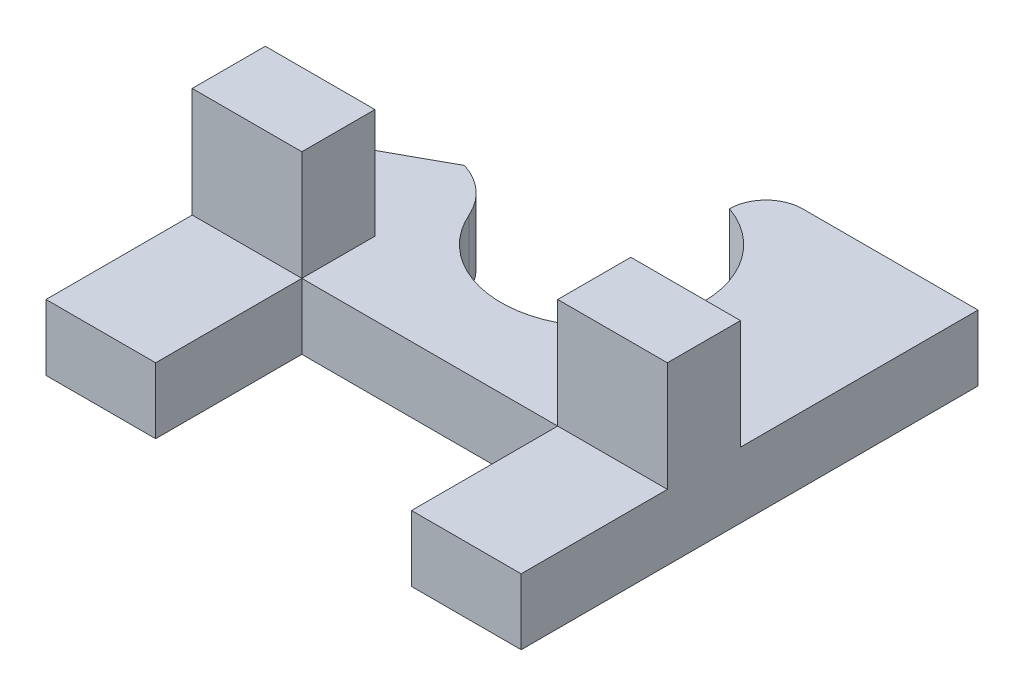
ISO-10303-21;
HEADER;
FILE_DESCRIPTION(('STEP AP214'),'2;1');
FILE_NAME('part.step','',(''),(''),'','','');
FILE_SCHEMA(('AUTOMOTIVE_DESIGN { 1 0 10303 214 1 1 1 1 }'));
ENDSEC;
DATA;
#1=APPLICATION_CONTEXT('core data for automotive mechanical design processes');
#2=APPLICATION_PROTOCOL_DEFINITION('international standard','automotive_design',2000,#1);
#3=PRODUCT_CONTEXT('',#1,'mechanical');
#4=PRODUCT('Part','Part','',(#3));
#5=PRODUCT_RELATED_PRODUCT_CATEGORY('part','',(#4));
#6=PRODUCT_DEFINITION_FORMATION('','',#4);
#7=PRODUCT_DEFINITION_CONTEXT('part definition',#1,'design');
#8=PRODUCT_DEFINITION('design','',#6,#7);
#9=PRODUCT_DEFINITION_SHAPE('','',#8);
#10=(LENGTH_UNIT() NAMED_UNIT(*) SI_UNIT(.MILLI.,.METRE.));
#11=(NAMED_UNIT(*) PLANE_ANGLE_UNIT() SI_UNIT($,.RADIAN.));
#12=(NAMED_UNIT(*) SI_UNIT($,.STERADIAN.) SOLID_ANGLE_UNIT());
#13=UNCERTAINTY_MEASURE_WITH_UNIT(LENGTH_MEASURE(1.E-05),#10,'distance_accuracy_value','');
#14=(GEOMETRIC_REPRESENTATION_CONTEXT(3) GLOBAL_UNCERTAINTY_ASSIGNED_CONTEXT((#13)) GLOBAL_UNIT_ASSIGNED_CONTEXT((#10,
#11,#12)) REPRESENTATION_CONTEXT('',''));
#15=CARTESIAN_POINT('',(0.,0.,0.));
#16=DIRECTION('',(0.,0.,1.));
#17=DIRECTION('',(1.,0.,0.));
#18=AXIS2_PLACEMENT_3D('',#15,#16,#17);
#19=CARTESIAN_POINT('',(-0.199999999999998,0.,-4.9));
#20=DIRECTION('',(0.,-1.,0.));
#21=DIRECTION('',(0.,0.,1.));
#22=AXIS2_PLACEMENT_3D('',#19,#20,#21);
#23=PLANE('',#22);
#24=DIRECTION('',(-1.,0.,0.));
#25=VECTOR('',#24,1.);
#26=CARTESIAN_POINT('',(-3.5,0.,0.));
#27=LINE('',#26,#25);
#28=CARTESIAN_POINT('',(-3.5,0.,0.));
#29=VERTEX_POINT('',#28);
#30=CARTESIAN_POINT('',(-6.5,0.,0.));
#31=VERTEX_POINT('',#30);
#32=EDGE_CURVE('E177',#29,#31,#27,.T.);
#33=ORIENTED_EDGE('',*,*,#32,.T.);
#34=DIRECTION('',(0.,0.,1.));
#35=VECTOR('',#34,1.);
#36=CARTESIAN_POINT('',(-6.5,0.,0.));
#37=LINE('',#36,#35);
#38=CARTESIAN_POINT('',(-6.5,0.,4.));
#39=VERTEX_POINT('',#38);
#40=EDGE_CURVE('E263',#31,#39,#37,.T.);
#41=ORIENTED_EDGE('',*,*,#40,.T.);
#42=DIRECTION('',(1.,0.,0.));
#43=VECTOR('',#42,1.);
#44=CARTESIAN_POINT('',(-6.5,0.,4.));
#45=LINE('',#44,#43);
#46=CARTESIAN_POINT('',(-3.5,0.,4.));
#47=VERTEX_POINT('',#46);
#48=EDGE_CURVE('E267',#39,#47,#45,.T.);
#49=ORIENTED_EDGE('',*,*,#48,.T.);
#50=DIRECTION('',(0.,0.,-1.));
#51=VECTOR('',#50,1.);
#52=CARTESIAN_POINT('',(-3.5,0.,0.));
#53=LINE('',#52,#51);
#54=EDGE_CURVE('E270',#47,#29,#53,.T.);
#55=ORIENTED_EDGE('',*,*,#54,.T.);
#56=EDGE_LOOP('',(#33,#41,#49,#55));
#57=FACE_BOUND('',#56,.T.);
#58=ADVANCED_FACE('F32',(#57),#23,.F.);
#59=DIRECTION('',(0.,0.,1.));
#60=VECTOR('',#59,1.);
#61=CARTESIAN_POINT('',(-3.5,0.,0.));
#62=LINE('',#61,#60);
#63=CARTESIAN_POINT('',(-3.5,0.,-2.));
#64=VERTEX_POINT('',#63);
#65=EDGE_CURVE('E193',#64,#29,#62,.T.);
#66=ORIENTED_EDGE('',*,*,#65,.T.);
#67=DIRECTION('',(1.,0.,0.));
#68=VECTOR('',#67,1.);
#69=CARTESIAN_POINT('',(3.5,0.,0.));
#70=LINE('',#69,#68);
#71=CARTESIAN_POINT('',(3.5,0.,0.));
#72=VERTEX_POINT('',#71);
#73=EDGE_CURVE('E273',#29,#72,#70,.T.);
#74=ORIENTED_EDGE('',*,*,#73,.T.);
#75=DIRECTION('',(0.,0.,-1.));
#76=VECTOR('',#75,1.);
#77=CARTESIAN_POINT('',(3.5,0.,0.));
#78=LINE('',#77,#76);
#79=CARTESIAN_POINT('',(3.5,0.,-2.));
#80=VERTEX_POINT('',#79);
#81=EDGE_CURVE('E181',#72,#80,#78,.T.);
#82=ORIENTED_EDGE('',*,*,#81,.T.);
#83=DIRECTION('',(1.,0.,0.));
#84=VECTOR('',#83,1.);
#85=CARTESIAN_POINT('',(3.5,0.,-2.));
#86=LINE('',#85,#84);
#87=CARTESIAN_POINT('',(6.5,0.,-2.));
#88=VERTEX_POINT('',#87);
#89=EDGE_CURVE('E214',#80,#88,#86,.T.);
#90=ORIENTED_EDGE('',*,*,#89,.T.);
#91=DIRECTION('',(0.,0.,-1.));
#92=VECTOR('',#91,1.);
#93=CARTESIAN_POINT('',(6.5,0.,-8.49855729203726));
#94=LINE('',#93,#92);
#95=CARTESIAN_POINT('',(6.5,0.,-8.49855729203726));
#96=VERTEX_POINT('',#95);
#97=EDGE_CURVE('E282',#88,#96,#94,.T.);
#98=ORIENTED_EDGE('',*,*,#97,.T.);
#99=DIRECTION('',(-1.,0.,0.));
#100=VECTOR('',#99,1.);
#101=CARTESIAN_POINT('',(0.699999999999999,0.,-8.49855729203726));
#102=LINE('',#101,#100);
#103=CARTESIAN_POINT('',(1.7,0.,-8.49855729203726));
#104=VERTEX_POINT('',#103);
#105=EDGE_CURVE('E230',#96,#104,#102,.T.);
#106=ORIENTED_EDGE('',*,*,#105,.T.);
#107=CARTESIAN_POINT('',(1.7,0.,-7.49855729203726));
#108=DIRECTION('',(0.,1.,0.));
#109=DIRECTION('',(0.,0.,1.));
#110=AXIS2_PLACEMENT_3D('',#107,#108,#109);
#111=CIRCLE('',#110,1.);
#112=CARTESIAN_POINT('',(0.699999999999999,0.,-7.49855729203726));
#113=VERTEX_POINT('',#112);
#114=EDGE_CURVE('E316',#113,#104,#111,.F.);
#115=ORIENTED_EDGE('',*,*,#114,.F.);
#116=CARTESIAN_POINT('',(-0.199999999999998,0.,-4.9));
#117=DIRECTION('',(0.,-1.,0.));
#118=DIRECTION('',(0.,0.,1.));
#119=AXIS2_PLACEMENT_3D('',#116,#117,#118);
#120=CIRCLE('',#119,2.75);
#121=CARTESIAN_POINT('',(-2.71842105263158,0.,-3.79543881941196));
#122=VERTEX_POINT('',#121);
#123=EDGE_CURVE('E225',#113,#122,#120,.T.);
#124=ORIENTED_EDGE('',*,*,#123,.T.);
#125=CARTESIAN_POINT('',(-4.55,0.,-2.99212159716611));
#126=DIRECTION('',(0.,1.,0.));
#127=DIRECTION('',(0.,0.,1.));
#128=AXIS2_PLACEMENT_3D('',#125,#126,#127);
#129=CIRCLE('',#128,2.);
#130=CARTESIAN_POINT('',(-3.95,0.,-4.9));
#131=VERTEX_POINT('',#130);
#132=EDGE_CURVE('E308',#131,#122,#129,.F.);
#133=ORIENTED_EDGE('',*,*,#132,.F.);
#134=DIRECTION('',(-0.876578550779595,0.,0.481258812192718));
#135=VECTOR('',#134,1.);
#136=CARTESIAN_POINT('',(-3.95,0.,-4.9));
#137=LINE('',#136,#135);
#138=CARTESIAN_POINT('',(-6.5,0.,-3.5));
#139=VERTEX_POINT('',#138);
#140=EDGE_CURVE('E260',#131,#139,#137,.T.);
#141=ORIENTED_EDGE('',*,*,#140,.T.);
#142=CARTESIAN_POINT('',(-6.5,0.,-2.));
#143=VERTEX_POINT('',#142);
#144=EDGE_CURVE('E264',#139,#143,#37,.T.);
#145=ORIENTED_EDGE('',*,*,#144,.T.);
#146=DIRECTION('',(1.,0.,0.));
#147=VECTOR('',#146,1.);
#148=CARTESIAN_POINT('',(-3.5,0.,-2.));
#149=LINE('',#148,#147);
#150=EDGE_CURVE('E185',#143,#64,#149,.T.);
#151=ORIENTED_EDGE('',*,*,#150,.T.);
#152=EDGE_LOOP('',(#66,#74,#82,#90,#98,#106,#115,#124,#133,#141,#145,#151));
#153=FACE_BOUND('',#152,.T.);
#154=ADVANCED_FACE('F336',(#153),#23,.F.);
#155=DIRECTION('',(-1.,0.,0.));
#156=VECTOR('',#155,1.);
#157=CARTESIAN_POINT('',(3.5,0.,0.));
#158=LINE('',#157,#156);
#159=CARTESIAN_POINT('',(6.5,0.,0.));
#160=VERTEX_POINT('',#159);
#161=EDGE_CURVE('E204',#160,#72,#158,.T.);
#162=ORIENTED_EDGE('',*,*,#161,.T.);
#163=DIRECTION('',(0.,0.,1.));
#164=VECTOR('',#163,1.);
#165=CARTESIAN_POINT('',(3.5,0.,0.));
#166=LINE('',#165,#164);
#167=CARTESIAN_POINT('',(3.5,0.,4.));
#168=VERTEX_POINT('',#167);
#169=EDGE_CURVE('E276',#72,#168,#166,.T.);
#170=ORIENTED_EDGE('',*,*,#169,.T.);
#171=DIRECTION('',(1.,0.,0.));
#172=VECTOR('',#171,1.);
#173=CARTESIAN_POINT('',(6.5,0.,4.));
#174=LINE('',#173,#172);
#175=CARTESIAN_POINT('',(6.5,0.,4.));
#176=VERTEX_POINT('',#175);
#177=EDGE_CURVE('E279',#168,#176,#174,.T.);
#178=ORIENTED_EDGE('',*,*,#177,.T.);
#179=EDGE_CURVE('E283',#176,#160,#94,.T.);
#180=ORIENTED_EDGE('',*,*,#179,.T.);
#181=EDGE_LOOP('',(#162,#170,#178,#180));
#182=FACE_BOUND('',#181,.T.);
#183=ADVANCED_FACE('F381',(#182),#23,.F.);
#184=CARTESIAN_POINT('',(-0.199999999999998,-1.8,-4.9));
#185=DIRECTION('',(0.,1.,0.));
#186=DIRECTION('',(0.,0.,-1.));
#187=AXIS2_PLACEMENT_3D('',#184,#185,#186);
#188=CYLINDRICAL_SURFACE('',#187,2.75);
#189=ORIENTED_EDGE('',*,*,#123,.F.);
#190=DIRECTION('',(0.,1.,0.));
#191=VECTOR('',#190,1.);
#192=CARTESIAN_POINT('',(0.699999999999999,-1.8,-7.49855729203726));
#193=LINE('',#192,#191);
#194=CARTESIAN_POINT('',(0.699999999999999,-1.8,-7.49855729203726));
#195=VERTEX_POINT('',#194);
#196=EDGE_CURVE('E257',#195,#113,#193,.T.);
#197=ORIENTED_EDGE('',*,*,#196,.F.);
#198=CARTESIAN_POINT('',(-0.199999999999998,-1.8,-4.9));
#199=DIRECTION('',(0.,-1.,0.));
#200=DIRECTION('',(0.,0.,1.));
#201=AXIS2_PLACEMENT_3D('',#198,#199,#200);
#202=CIRCLE('',#201,2.75);
#203=CARTESIAN_POINT('',(-2.71842105263158,-1.8,-3.79543881941196));
#204=VERTEX_POINT('',#203);
#205=EDGE_CURVE('E226',#195,#204,#202,.T.);
#206=ORIENTED_EDGE('',*,*,#205,.T.);
#207=DIRECTION('',(0.,1.,0.));
#208=VECTOR('',#207,1.);
#209=CARTESIAN_POINT('',(-2.71842105263158,-1.8,-3.79543881941196));
#210=LINE('',#209,#208);
#211=EDGE_CURVE('E311',#122,#204,#210,.F.);
#212=ORIENTED_EDGE('',*,*,#211,.F.);
#213=EDGE_LOOP('',(#189,#197,#206,#212));
#214=FACE_BOUND('',#213,.T.);
#215=ADVANCED_FACE('F333',(#214),#188,.F.);
#216=CARTESIAN_POINT('',(-3.95,-1.8,-4.9));
#217=DIRECTION('',(0.481258812192718,0.,0.876578550779595));
#218=DIRECTION('',(0.876578550779595,0.,-0.481258812192718));
#219=AXIS2_PLACEMENT_3D('',#216,#217,#218);
#220=PLANE('',#219);
#221=ORIENTED_EDGE('',*,*,#140,.F.);
#222=DIRECTION('',(0.,1.,0.));
#223=VECTOR('',#222,1.);
#224=CARTESIAN_POINT('',(-3.95,-1.8,-4.9));
#225=LINE('',#224,#223);
#226=CARTESIAN_POINT('',(-3.95,-1.8,-4.9));
#227=VERTEX_POINT('',#226);
#228=EDGE_CURVE('E306',#227,#131,#225,.T.);
#229=ORIENTED_EDGE('',*,*,#228,.F.);
#230=DIRECTION('',(-0.876578550779595,0.,0.481258812192718));
#231=VECTOR('',#230,1.);
#232=CARTESIAN_POINT('',(-3.95,-1.8,-4.9));
#233=LINE('',#232,#231);
#234=CARTESIAN_POINT('',(-6.5,-1.8,-3.5));
#235=VERTEX_POINT('',#234);
#236=EDGE_CURVE('E229',#227,#235,#233,.T.);
#237=ORIENTED_EDGE('',*,*,#236,.T.);
#238=DIRECTION('',(0.,1.,0.));
#239=VECTOR('',#238,1.);
#240=CARTESIAN_POINT('',(-6.5,-1.8,-3.5));
#241=LINE('',#240,#239);
#242=EDGE_CURVE('E304',#235,#139,#241,.T.);
#243=ORIENTED_EDGE('',*,*,#242,.T.);
#244=EDGE_LOOP('',(#221,#229,#237,#243));
#245=FACE_BOUND('',#244,.T.);
#246=ADVANCED_FACE('F371',(#245),#220,.F.);
#247=CARTESIAN_POINT('',(-6.5,-1.8,0.));
#248=DIRECTION('',(1.,0.,0.));
#249=DIRECTION('',(0.,0.,-1.));
#250=AXIS2_PLACEMENT_3D('',#247,#248,#249);
#251=PLANE('',#250);
#252=ORIENTED_EDGE('',*,*,#144,.F.);
#253=ORIENTED_EDGE('',*,*,#242,.F.);
#254=DIRECTION('',(0.,0.,1.));
#255=VECTOR('',#254,1.);
#256=CARTESIAN_POINT('',(-6.5,-1.8,-2.5));
#257=LINE('',#256,#255);
#258=CARTESIAN_POINT('',(-6.5,-1.8,4.));
#259=VERTEX_POINT('',#258);
#260=EDGE_CURVE('E233',#235,#259,#257,.T.);
#261=ORIENTED_EDGE('',*,*,#260,.T.);
#262=DIRECTION('',(0.,1.,0.));
#263=VECTOR('',#262,1.);
#264=CARTESIAN_POINT('',(-6.5,-1.8,4.));
#265=LINE('',#264,#263);
#266=EDGE_CURVE('E302',#259,#39,#265,.T.);
#267=ORIENTED_EDGE('',*,*,#266,.T.);
#268=ORIENTED_EDGE('',*,*,#40,.F.);
#269=DIRECTION('',(0.,-1.,0.));
#270=VECTOR('',#269,1.);
#271=CARTESIAN_POINT('',(-6.5,3.,0.));
#272=LINE('',#271,#270);
#273=CARTESIAN_POINT('',(-6.5,3.,0.));
#274=VERTEX_POINT('',#273);
#275=EDGE_CURVE('E47',#274,#31,#272,.T.);
#276=ORIENTED_EDGE('',*,*,#275,.F.);
#277=DIRECTION('',(0.,0.,-1.));
#278=VECTOR('',#277,1.);
#279=CARTESIAN_POINT('',(-6.5,3.,0.));
#280=LINE('',#279,#278);
#281=CARTESIAN_POINT('',(-6.5,3.,-2.));
#282=VERTEX_POINT('',#281);
#283=EDGE_CURVE('E172',#274,#282,#280,.T.);
#284=ORIENTED_EDGE('',*,*,#283,.T.);
#285=DIRECTION('',(0.,-1.,0.));
#286=VECTOR('',#285,1.);
#287=CARTESIAN_POINT('',(-6.5,3.,-2.));
#288=LINE('',#287,#286);
#289=EDGE_CURVE('E198',#282,#143,#288,.T.);
#290=ORIENTED_EDGE('',*,*,#289,.T.);
#291=EDGE_LOOP('',(#252,#253,#261,#267,#268,#276,#284,#290));
#292=FACE_BOUND('',#291,.T.);
#293=ADVANCED_FACE('F367',(#292),#251,.F.);
#294=CARTESIAN_POINT('',(-6.5,-1.8,4.));
#295=DIRECTION('',(0.,0.,-1.));
#296=DIRECTION('',(-1.,0.,0.));
#297=AXIS2_PLACEMENT_3D('',#294,#295,#296);
#298=PLANE('',#297);
#299=ORIENTED_EDGE('',*,*,#48,.F.);
#300=ORIENTED_EDGE('',*,*,#266,.F.);
#301=DIRECTION('',(1.,0.,0.));
#302=VECTOR('',#301,1.);
#303=CARTESIAN_POINT('',(-6.5,-1.8,4.));
#304=LINE('',#303,#302);
#305=CARTESIAN_POINT('',(-3.5,-1.8,4.));
#306=VERTEX_POINT('',#305);
#307=EDGE_CURVE('E236',#259,#306,#304,.T.);
#308=ORIENTED_EDGE('',*,*,#307,.T.);
#309=DIRECTION('',(0.,1.,0.));
#310=VECTOR('',#309,1.);
#311=CARTESIAN_POINT('',(-3.5,-1.8,4.));
#312=LINE('',#311,#310);
#313=EDGE_CURVE('E300',#306,#47,#312,.T.);
#314=ORIENTED_EDGE('',*,*,#313,.T.);
#315=EDGE_LOOP('',(#299,#300,#308,#314));
#316=FACE_BOUND('',#315,.T.);
#317=ADVANCED_FACE('F363',(#316),#298,.F.);
#318=CARTESIAN_POINT('',(-3.5,-1.8,0.));
#319=DIRECTION('',(-1.,0.,0.));
#320=DIRECTION('',(0.,0.,1.));
#321=AXIS2_PLACEMENT_3D('',#318,#319,#320);
#322=PLANE('',#321);
#323=ORIENTED_EDGE('',*,*,#54,.F.);
#324=ORIENTED_EDGE('',*,*,#313,.F.);
#325=DIRECTION('',(0.,0.,-1.));
#326=VECTOR('',#325,1.);
#327=CARTESIAN_POINT('',(-3.5,-1.8,0.));
#328=LINE('',#327,#326);
#329=CARTESIAN_POINT('',(-3.5,-1.8,0.));
#330=VERTEX_POINT('',#329);
#331=EDGE_CURVE('E239',#306,#330,#328,.T.);
#332=ORIENTED_EDGE('',*,*,#331,.T.);
#333=DIRECTION('',(0.,1.,0.));
#334=VECTOR('',#333,1.);
#335=CARTESIAN_POINT('',(-3.5,-1.8,0.));
#336=LINE('',#335,#334);
#337=EDGE_CURVE('E298',#330,#29,#336,.T.);
#338=ORIENTED_EDGE('',*,*,#337,.T.);
#339=EDGE_LOOP('',(#323,#324,#332,#338));
#340=FACE_BOUND('',#339,.T.);
#341=ADVANCED_FACE('F358',(#340),#322,.F.);
#342=CARTESIAN_POINT('',(3.5,-1.8,0.));
#343=DIRECTION('',(0.,0.,-1.));
#344=DIRECTION('',(-1.,0.,0.));
#345=AXIS2_PLACEMENT_3D('',#342,#343,#344);
#346=PLANE('',#345);
#347=ORIENTED_EDGE('',*,*,#73,.F.);
#348=ORIENTED_EDGE('',*,*,#337,.F.);
#349=DIRECTION('',(1.,0.,0.));
#350=VECTOR('',#349,1.);
#351=CARTESIAN_POINT('',(3.5,-1.8,0.));
#352=LINE('',#351,#350);
#353=CARTESIAN_POINT('',(3.5,-1.8,0.));
#354=VERTEX_POINT('',#353);
#355=EDGE_CURVE('E242',#330,#354,#352,.T.);
#356=ORIENTED_EDGE('',*,*,#355,.T.);
#357=DIRECTION('',(0.,1.,0.));
#358=VECTOR('',#357,1.);
#359=CARTESIAN_POINT('',(3.5,-1.8,0.));
#360=LINE('',#359,#358);
#361=EDGE_CURVE('E295',#354,#72,#360,.T.);
#362=ORIENTED_EDGE('',*,*,#361,.T.);
#363=EDGE_LOOP('',(#347,#348,#356,#362));
#364=FACE_BOUND('',#363,.T.);
#365=ADVANCED_FACE('F354',(#364),#346,.F.);
#366=CARTESIAN_POINT('',(3.5,-1.8,0.));
#367=DIRECTION('',(1.,0.,0.));
#368=DIRECTION('',(0.,0.,-1.));
#369=AXIS2_PLACEMENT_3D('',#366,#367,#368);
#370=PLANE('',#369);
#371=ORIENTED_EDGE('',*,*,#169,.F.);
#372=ORIENTED_EDGE('',*,*,#361,.F.);
#373=DIRECTION('',(0.,0.,1.));
#374=VECTOR('',#373,1.);
#375=CARTESIAN_POINT('',(3.5,-1.8,0.));
#376=LINE('',#375,#374);
#377=CARTESIAN_POINT('',(3.5,-1.8,4.));
#378=VERTEX_POINT('',#377);
#379=EDGE_CURVE('E245',#354,#378,#376,.T.);
#380=ORIENTED_EDGE('',*,*,#379,.T.);
#381=DIRECTION('',(0.,1.,0.));
#382=VECTOR('',#381,1.);
#383=CARTESIAN_POINT('',(3.5,-1.8,4.));
#384=LINE('',#383,#382);
#385=EDGE_CURVE('E293',#378,#168,#384,.T.);
#386=ORIENTED_EDGE('',*,*,#385,.T.);
#387=EDGE_LOOP('',(#371,#372,#380,#386));
#388=FACE_BOUND('',#387,.T.);
#389=ADVANCED_FACE('F351',(#388),#370,.F.);
#390=CARTESIAN_POINT('',(6.5,-1.8,4.));
#391=DIRECTION('',(0.,0.,-1.));
#392=DIRECTION('',(-1.,0.,0.));
#393=AXIS2_PLACEMENT_3D('',#390,#391,#392);
#394=PLANE('',#393);
#395=ORIENTED_EDGE('',*,*,#177,.F.);
#396=ORIENTED_EDGE('',*,*,#385,.F.);
#397=DIRECTION('',(1.,0.,0.));
#398=VECTOR('',#397,1.);
#399=CARTESIAN_POINT('',(6.5,-1.8,4.));
#400=LINE('',#399,#398);
#401=CARTESIAN_POINT('',(6.5,-1.8,4.));
#402=VERTEX_POINT('',#401);
#403=EDGE_CURVE('E248',#378,#402,#400,.T.);
#404=ORIENTED_EDGE('',*,*,#403,.T.);
#405=DIRECTION('',(0.,1.,0.));
#406=VECTOR('',#405,1.);
#407=CARTESIAN_POINT('',(6.5,-1.8,4.));
#408=LINE('',#407,#406);
#409=EDGE_CURVE('E291',#402,#176,#408,.T.);
#410=ORIENTED_EDGE('',*,*,#409,.T.);
#411=EDGE_LOOP('',(#395,#396,#404,#410));
#412=FACE_BOUND('',#411,.T.);
#413=ADVANCED_FACE('F346',(#412),#394,.F.);
#414=CARTESIAN_POINT('',(6.5,-1.8,-8.49855729203726));
#415=DIRECTION('',(-1.,0.,0.));
#416=DIRECTION('',(0.,0.,1.));
#417=AXIS2_PLACEMENT_3D('',#414,#415,#416);
#418=PLANE('',#417);
#419=ORIENTED_EDGE('',*,*,#179,.F.);
#420=ORIENTED_EDGE('',*,*,#409,.F.);
#421=DIRECTION('',(0.,0.,-1.));
#422=VECTOR('',#421,1.);
#423=CARTESIAN_POINT('',(6.5,-1.8,0.));
#424=LINE('',#423,#422);
#425=CARTESIAN_POINT('',(6.5,-1.8,-8.49855729203726));
#426=VERTEX_POINT('',#425);
#427=EDGE_CURVE('E251',#402,#426,#424,.T.);
#428=ORIENTED_EDGE('',*,*,#427,.T.);
#429=DIRECTION('',(0.,1.,0.));
#430=VECTOR('',#429,1.);
#431=CARTESIAN_POINT('',(6.5,-1.8,-8.49855729203726));
#432=LINE('',#431,#430);
#433=EDGE_CURVE('E289',#426,#96,#432,.T.);
#434=ORIENTED_EDGE('',*,*,#433,.T.);
#435=ORIENTED_EDGE('',*,*,#97,.F.);
#436=DIRECTION('',(0.,-1.,0.));
#437=VECTOR('',#436,1.);
#438=CARTESIAN_POINT('',(6.5,3.,-2.));
#439=LINE('',#438,#437);
#440=CARTESIAN_POINT('',(6.5,3.,-2.));
#441=VERTEX_POINT('',#440);
#442=EDGE_CURVE('E222',#441,#88,#439,.T.);
#443=ORIENTED_EDGE('',*,*,#442,.F.);
#444=DIRECTION('',(0.,0.,1.));
#445=VECTOR('',#444,1.);
#446=CARTESIAN_POINT('',(6.5,3.,0.));
#447=LINE('',#446,#445);
#448=CARTESIAN_POINT('',(6.5,3.,0.));
#449=VERTEX_POINT('',#448);
#450=EDGE_CURVE('E206',#441,#449,#447,.T.);
#451=ORIENTED_EDGE('',*,*,#450,.T.);
#452=DIRECTION('',(0.,-1.,0.));
#453=VECTOR('',#452,1.);
#454=CARTESIAN_POINT('',(6.5,3.,0.));
#455=LINE('',#454,#453);
#456=EDGE_CURVE('E220',#449,#160,#455,.T.);
#457=ORIENTED_EDGE('',*,*,#456,.T.);
#458=EDGE_LOOP('',(#419,#420,#428,#434,#435,#443,#451,#457));
#459=FACE_BOUND('',#458,.T.);
#460=ADVANCED_FACE('F342',(#459),#418,.F.);
#461=CARTESIAN_POINT('',(0.699999999999999,-1.8,-8.49855729203726));
#462=DIRECTION('',(0.,0.,1.));
#463=DIRECTION('',(1.,0.,0.));
#464=AXIS2_PLACEMENT_3D('',#461,#462,#463);
#465=PLANE('',#464);
#466=ORIENTED_EDGE('',*,*,#105,.F.);
#467=ORIENTED_EDGE('',*,*,#433,.F.);
#468=DIRECTION('',(-1.,0.,0.));
#469=VECTOR('',#468,1.);
#470=CARTESIAN_POINT('',(0.699999999999999,-1.8,-8.49855729203726));
#471=LINE('',#470,#469);
#472=CARTESIAN_POINT('',(1.7,-1.8,-8.49855729203726));
#473=VERTEX_POINT('',#472);
#474=EDGE_CURVE('E254',#426,#473,#471,.T.);
#475=ORIENTED_EDGE('',*,*,#474,.T.);
#476=DIRECTION('',(0.,1.,0.));
#477=VECTOR('',#476,1.);
#478=CARTESIAN_POINT('',(1.7,-1.8,-8.49855729203726));
#479=LINE('',#478,#477);
#480=EDGE_CURVE('E40',#104,#473,#479,.F.);
#481=ORIENTED_EDGE('',*,*,#480,.F.);
#482=EDGE_LOOP('',(#466,#467,#475,#481));
#483=FACE_BOUND('',#482,.T.);
#484=ADVANCED_FACE('F325',(#483),#465,.F.);
#485=CARTESIAN_POINT('',(-0.199999999999998,-1.8,-4.9));
#486=DIRECTION('',(0.,-1.,0.));
#487=DIRECTION('',(0.,0.,1.));
#488=AXIS2_PLACEMENT_3D('',#485,#486,#487);
#489=PLANE('',#488);
#490=ORIENTED_EDGE('',*,*,#474,.F.);
#491=ORIENTED_EDGE('',*,*,#427,.F.);
#492=ORIENTED_EDGE('',*,*,#403,.F.);
#493=ORIENTED_EDGE('',*,*,#379,.F.);
#494=ORIENTED_EDGE('',*,*,#355,.F.);
#495=ORIENTED_EDGE('',*,*,#331,.F.);
#496=ORIENTED_EDGE('',*,*,#307,.F.);
#497=ORIENTED_EDGE('',*,*,#260,.F.);
#498=ORIENTED_EDGE('',*,*,#236,.F.);
#499=CARTESIAN_POINT('',(-4.55,-1.8,-2.99212159716611));
#500=DIRECTION('',(0.,1.,0.));
#501=DIRECTION('',(0.,0.,1.));
#502=AXIS2_PLACEMENT_3D('',#499,#500,#501);
#503=CIRCLE('',#502,2.);
#504=EDGE_CURVE('E314',#204,#227,#503,.T.);
#505=ORIENTED_EDGE('',*,*,#504,.F.);
#506=ORIENTED_EDGE('',*,*,#205,.F.);
#507=CARTESIAN_POINT('',(1.7,-1.8,-7.49855729203726));
#508=DIRECTION('',(0.,1.,0.));
#509=DIRECTION('',(0.,0.,1.));
#510=AXIS2_PLACEMENT_3D('',#507,#508,#509);
#511=CIRCLE('',#510,1.);
#512=EDGE_CURVE('E11',#473,#195,#511,.T.);
#513=ORIENTED_EDGE('',*,*,#512,.F.);
#514=EDGE_LOOP('',(#490,#491,#492,#493,#494,#495,#496,#497,#498,#505,#506,#513));
#515=FACE_BOUND('',#514,.T.);
#516=ADVANCED_FACE('F327',(#515),#489,.T.);
#517=CARTESIAN_POINT('',(-4.55,-1.8,-2.99212159716611));
#518=DIRECTION('',(0.,1.,0.));
#519=DIRECTION('',(0.,0.,-1.));
#520=AXIS2_PLACEMENT_3D('',#517,#518,#519);
#521=CYLINDRICAL_SURFACE('',#520,2.);
#522=ORIENTED_EDGE('',*,*,#504,.T.);
#523=ORIENTED_EDGE('',*,*,#228,.T.);
#524=ORIENTED_EDGE('',*,*,#132,.T.);
#525=ORIENTED_EDGE('',*,*,#211,.T.);
#526=EDGE_LOOP('',(#522,#523,#524,#525));
#527=FACE_BOUND('',#526,.T.);
#528=ADVANCED_FACE('F373',(#527),#521,.T.);
#529=CARTESIAN_POINT('',(1.7,-1.8,-7.49855729203726));
#530=DIRECTION('',(0.,1.,0.));
#531=DIRECTION('',(0.,0.,-1.));
#532=AXIS2_PLACEMENT_3D('',#529,#530,#531);
#533=CYLINDRICAL_SURFACE('',#532,1.);
#534=ORIENTED_EDGE('',*,*,#512,.T.);
#535=ORIENTED_EDGE('',*,*,#196,.T.);
#536=ORIENTED_EDGE('',*,*,#114,.T.);
#537=ORIENTED_EDGE('',*,*,#480,.T.);
#538=EDGE_LOOP('',(#534,#535,#536,#537));
#539=FACE_BOUND('',#538,.T.);
#540=ADVANCED_FACE('F34',(#539),#533,.T.);
#541=CARTESIAN_POINT('',(3.5,3.,0.));
#542=DIRECTION('',(1.,0.,0.));
#543=DIRECTION('',(0.,0.,-1.));
#544=AXIS2_PLACEMENT_3D('',#541,#542,#543);
#545=PLANE('',#544);
#546=ORIENTED_EDGE('',*,*,#81,.F.);
#547=DIRECTION('',(0.,-1.,0.));
#548=VECTOR('',#547,1.);
#549=CARTESIAN_POINT('',(3.5,3.,0.));
#550=LINE('',#549,#548);
#551=CARTESIAN_POINT('',(3.5,3.,0.));
#552=VERTEX_POINT('',#551);
#553=EDGE_CURVE('E211',#552,#72,#550,.T.);
#554=ORIENTED_EDGE('',*,*,#553,.F.);
#555=DIRECTION('',(0.,0.,-1.));
#556=VECTOR('',#555,1.);
#557=CARTESIAN_POINT('',(3.5,3.,0.));
#558=LINE('',#557,#556);
#559=CARTESIAN_POINT('',(3.5,3.,-2.));
#560=VERTEX_POINT('',#559);
#561=EDGE_CURVE('E201',#552,#560,#558,.T.);
#562=ORIENTED_EDGE('',*,*,#561,.T.);
#563=DIRECTION('',(0.,-1.,0.));
#564=VECTOR('',#563,1.);
#565=CARTESIAN_POINT('',(3.5,3.,-2.));
#566=LINE('',#565,#564);
#567=EDGE_CURVE('E55',#560,#80,#566,.T.);
#568=ORIENTED_EDGE('',*,*,#567,.T.);
#569=EDGE_LOOP('',(#546,#554,#562,#568));
#570=FACE_BOUND('',#569,.T.);
#571=ADVANCED_FACE('F397',(#570),#545,.F.);
#572=CARTESIAN_POINT('',(3.5,3.,-2.));
#573=DIRECTION('',(0.,0.,1.));
#574=DIRECTION('',(1.,0.,0.));
#575=AXIS2_PLACEMENT_3D('',#572,#573,#574);
#576=PLANE('',#575);
#577=ORIENTED_EDGE('',*,*,#89,.F.);
#578=ORIENTED_EDGE('',*,*,#567,.F.);
#579=DIRECTION('',(1.,0.,0.));
#580=VECTOR('',#579,1.);
#581=CARTESIAN_POINT('',(3.5,3.,-2.));
#582=LINE('',#581,#580);
#583=EDGE_CURVE('E203',#560,#441,#582,.T.);
#584=ORIENTED_EDGE('',*,*,#583,.T.);
#585=ORIENTED_EDGE('',*,*,#442,.T.);
#586=EDGE_LOOP('',(#577,#578,#584,#585));
#587=FACE_BOUND('',#586,.T.);
#588=ADVANCED_FACE('F404',(#587),#576,.F.);
#589=CARTESIAN_POINT('',(3.5,3.,0.));
#590=DIRECTION('',(0.,0.,-1.));
#591=DIRECTION('',(-1.,0.,0.));
#592=AXIS2_PLACEMENT_3D('',#589,#590,#591);
#593=PLANE('',#592);
#594=ORIENTED_EDGE('',*,*,#161,.F.);
#595=ORIENTED_EDGE('',*,*,#456,.F.);
#596=DIRECTION('',(-1.,0.,0.));
#597=VECTOR('',#596,1.);
#598=CARTESIAN_POINT('',(3.5,3.,0.));
#599=LINE('',#598,#597);
#600=EDGE_CURVE('E209',#449,#552,#599,.T.);
#601=ORIENTED_EDGE('',*,*,#600,.T.);
#602=ORIENTED_EDGE('',*,*,#553,.T.);
#603=EDGE_LOOP('',(#594,#595,#601,#602));
#604=FACE_BOUND('',#603,.T.);
#605=ADVANCED_FACE('F399',(#604),#593,.F.);
#606=CARTESIAN_POINT('',(0.,3.,0.));
#607=DIRECTION('',(0.,1.,0.));
#608=DIRECTION('',(0.,0.,-1.));
#609=AXIS2_PLACEMENT_3D('',#606,#607,#608);
#610=PLANE('',#609);
#611=ORIENTED_EDGE('',*,*,#561,.F.);
#612=ORIENTED_EDGE('',*,*,#600,.F.);
#613=ORIENTED_EDGE('',*,*,#450,.F.);
#614=ORIENTED_EDGE('',*,*,#583,.F.);
#615=EDGE_LOOP('',(#611,#612,#613,#614));
#616=FACE_BOUND('',#615,.T.);
#617=ADVANCED_FACE('F402',(#616),#610,.T.);
#618=CARTESIAN_POINT('',(-3.5,3.,0.));
#619=DIRECTION('',(-1.,0.,0.));
#620=DIRECTION('',(0.,0.,1.));
#621=AXIS2_PLACEMENT_3D('',#618,#619,#620);
#622=PLANE('',#621);
#623=ORIENTED_EDGE('',*,*,#65,.F.);
#624=DIRECTION('',(0.,-1.,0.));
#625=VECTOR('',#624,1.);
#626=CARTESIAN_POINT('',(-3.5,3.,-2.));
#627=LINE('',#626,#625);
#628=CARTESIAN_POINT('',(-3.5,3.,-2.));
#629=VERTEX_POINT('',#628);
#630=EDGE_CURVE('E184',#629,#64,#627,.T.);
#631=ORIENTED_EDGE('',*,*,#630,.F.);
#632=DIRECTION('',(0.,0.,1.));
#633=VECTOR('',#632,1.);
#634=CARTESIAN_POINT('',(-3.5,3.,0.));
#635=LINE('',#634,#633);
#636=CARTESIAN_POINT('',(-3.5,3.,0.));
#637=VERTEX_POINT('',#636);
#638=EDGE_CURVE('E169',#629,#637,#635,.T.);
#639=ORIENTED_EDGE('',*,*,#638,.T.);
#640=DIRECTION('',(0.,-1.,0.));
#641=VECTOR('',#640,1.);
#642=CARTESIAN_POINT('',(-3.5,3.,0.));
#643=LINE('',#642,#641);
#644=EDGE_CURVE('E174',#637,#29,#643,.T.);
#645=ORIENTED_EDGE('',*,*,#644,.T.);
#646=EDGE_LOOP('',(#623,#631,#639,#645));
#647=FACE_BOUND('',#646,.T.);
#648=ADVANCED_FACE('F183',(#647),#622,.F.);
#649=CARTESIAN_POINT('',(-3.5,3.,0.));
#650=DIRECTION('',(0.,0.,-1.));
#651=DIRECTION('',(-1.,0.,0.));
#652=AXIS2_PLACEMENT_3D('',#649,#650,#651);
#653=PLANE('',#652);
#654=ORIENTED_EDGE('',*,*,#32,.F.);
#655=ORIENTED_EDGE('',*,*,#644,.F.);
#656=DIRECTION('',(-1.,0.,0.));
#657=VECTOR('',#656,1.);
#658=CARTESIAN_POINT('',(-3.5,3.,0.));
#659=LINE('',#658,#657);
#660=EDGE_CURVE('E165',#637,#274,#659,.T.);
#661=ORIENTED_EDGE('',*,*,#660,.T.);
#662=ORIENTED_EDGE('',*,*,#275,.T.);
#663=EDGE_LOOP('',(#654,#655,#661,#662));
#664=FACE_BOUND('',#663,.T.);
#665=ADVANCED_FACE('F175',(#664),#653,.F.);
#666=CARTESIAN_POINT('',(-3.5,3.,-2.));
#667=DIRECTION('',(0.,0.,1.));
#668=DIRECTION('',(1.,0.,0.));
#669=AXIS2_PLACEMENT_3D('',#666,#667,#668);
#670=PLANE('',#669);
#671=ORIENTED_EDGE('',*,*,#150,.F.);
#672=ORIENTED_EDGE('',*,*,#289,.F.);
#673=DIRECTION('',(1.,0.,0.));
#674=VECTOR('',#673,1.);
#675=CARTESIAN_POINT('',(-3.5,3.,-2.));
#676=LINE('',#675,#674);
#677=EDGE_CURVE('E191',#282,#629,#676,.T.);
#678=ORIENTED_EDGE('',*,*,#677,.T.);
#679=ORIENTED_EDGE('',*,*,#630,.T.);
#680=EDGE_LOOP('',(#671,#672,#678,#679));
#681=FACE_BOUND('',#680,.T.);
#682=ADVANCED_FACE('F377',(#681),#670,.F.);
#683=CARTESIAN_POINT('',(0.,3.,0.));
#684=DIRECTION('',(0.,-1.,0.));
#685=DIRECTION('',(0.,0.,1.));
#686=AXIS2_PLACEMENT_3D('',#683,#684,#685);
#687=PLANE('',#686);
#688=ORIENTED_EDGE('',*,*,#638,.F.);
#689=ORIENTED_EDGE('',*,*,#677,.F.);
#690=ORIENTED_EDGE('',*,*,#283,.F.);
#691=ORIENTED_EDGE('',*,*,#660,.F.);
#692=EDGE_LOOP('',(#688,#689,#690,#691));
#693=FACE_BOUND('',#692,.T.);
#694=ADVANCED_FACE('F167',(#693),#687,.F.);
#695=CLOSED_SHELL('',(#58,#154,#183,#215,#246,#293,#317,#341,#365,#389,#413,#460,#484,#516,#528,
#540,#571,#588,#605,#617,#648,#665,#682,#694));
#696=MANIFOLD_SOLID_BREP('B2',#695);
#697=ADVANCED_BREP_SHAPE_REPRESENTATION('',(#18,#696),#14);
#698=SHAPE_DEFINITION_REPRESENTATION(#9,#697);
ENDSEC;
END-ISO-10303-21;
